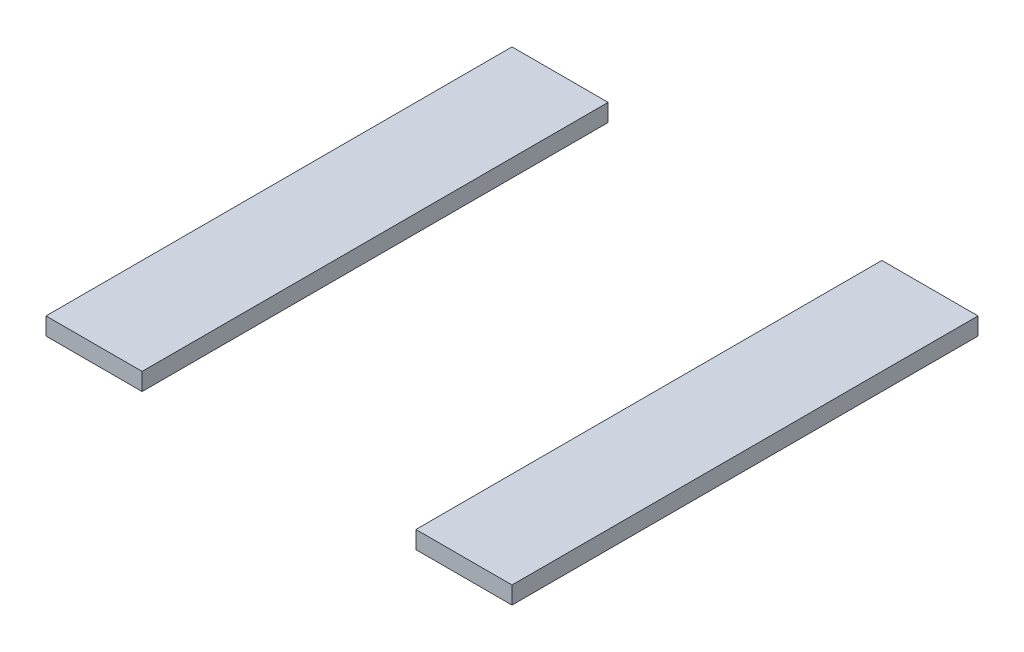
ISO-10303-21;
HEADER;
FILE_DESCRIPTION(('STEP AP214'),'2;1');
FILE_NAME('part.step','',(''),(''),'','','');
FILE_SCHEMA(('AUTOMOTIVE_DESIGN { 1 0 10303 214 1 1 1 1 }'));
ENDSEC;
DATA;
#1=APPLICATION_CONTEXT('core data for automotive mechanical design processes');
#2=APPLICATION_PROTOCOL_DEFINITION('international standard','automotive_design',2000,#1);
#3=PRODUCT_CONTEXT('',#1,'mechanical');
#4=PRODUCT('Part','Part','',(#3));
#5=PRODUCT_RELATED_PRODUCT_CATEGORY('part','',(#4));
#6=PRODUCT_DEFINITION_FORMATION('','',#4);
#7=PRODUCT_DEFINITION_CONTEXT('part definition',#1,'design');
#8=PRODUCT_DEFINITION('design','',#6,#7);
#9=PRODUCT_DEFINITION_SHAPE('','',#8);
#10=(LENGTH_UNIT() NAMED_UNIT(*) SI_UNIT(.MILLI.,.METRE.));
#11=(NAMED_UNIT(*) PLANE_ANGLE_UNIT() SI_UNIT($,.RADIAN.));
#12=(NAMED_UNIT(*) SI_UNIT($,.STERADIAN.) SOLID_ANGLE_UNIT());
#13=UNCERTAINTY_MEASURE_WITH_UNIT(LENGTH_MEASURE(1.E-05),#10,'distance_accuracy_value','');
#14=(GEOMETRIC_REPRESENTATION_CONTEXT(3) GLOBAL_UNCERTAINTY_ASSIGNED_CONTEXT((#13)) GLOBAL_UNIT_ASSIGNED_CONTEXT((#10,
#11,#12)) REPRESENTATION_CONTEXT('',''));
#15=CARTESIAN_POINT('',(0.,0.,0.));
#16=DIRECTION('',(0.,0.,1.));
#17=DIRECTION('',(1.,0.,0.));
#18=AXIS2_PLACEMENT_3D('',#15,#16,#17);
#19=CARTESIAN_POINT('',(-63.5,-3.,-80.));
#20=DIRECTION('',(0.,0.,-1.));
#21=DIRECTION('',(-1.,0.,0.));
#22=AXIS2_PLACEMENT_3D('',#19,#20,#21);
#23=PLANE('',#22);
#24=DIRECTION('',(-1.,0.,0.));
#25=VECTOR('',#24,1.);
#26=CARTESIAN_POINT('',(-63.5,0.,-80.));
#27=LINE('',#26,#25);
#28=CARTESIAN_POINT('',(-63.5,0.,-80.));
#29=VERTEX_POINT('',#28);
#30=CARTESIAN_POINT('',(-80.,0.,-80.));
#31=VERTEX_POINT('',#30);
#32=EDGE_CURVE('E107',#29,#31,#27,.T.);
#33=ORIENTED_EDGE('',*,*,#32,.F.);
#34=DIRECTION('',(0.,1.,0.));
#35=VECTOR('',#34,1.);
#36=CARTESIAN_POINT('',(-63.5,-3.,-80.));
#37=LINE('',#36,#35);
#38=CARTESIAN_POINT('',(-63.5,-3.,-80.));
#39=VERTEX_POINT('',#38);
#40=EDGE_CURVE('E12',#39,#29,#37,.T.);
#41=ORIENTED_EDGE('',*,*,#40,.F.);
#42=DIRECTION('',(-1.,0.,0.));
#43=VECTOR('',#42,1.);
#44=CARTESIAN_POINT('',(-63.5,-3.,-80.));
#45=LINE('',#44,#43);
#46=CARTESIAN_POINT('',(-80.,-3.,-80.));
#47=VERTEX_POINT('',#46);
#48=EDGE_CURVE('E101',#39,#47,#45,.T.);
#49=ORIENTED_EDGE('',*,*,#48,.T.);
#50=DIRECTION('',(0.,1.,0.));
#51=VECTOR('',#50,1.);
#52=CARTESIAN_POINT('',(-80.,-3.,-80.));
#53=LINE('',#52,#51);
#54=EDGE_CURVE('E46',#47,#31,#53,.T.);
#55=ORIENTED_EDGE('',*,*,#54,.T.);
#56=EDGE_LOOP('',(#33,#41,#49,#55));
#57=FACE_BOUND('',#56,.T.);
#58=ADVANCED_FACE('F43',(#57),#23,.T.);
#59=CARTESIAN_POINT('',(-63.5,-3.,0.));
#60=DIRECTION('',(1.,0.,0.));
#61=DIRECTION('',(0.,0.,-1.));
#62=AXIS2_PLACEMENT_3D('',#59,#60,#61);
#63=PLANE('',#62);
#64=DIRECTION('',(0.,0.,-1.));
#65=VECTOR('',#64,1.);
#66=CARTESIAN_POINT('',(-63.5,0.,0.));
#67=LINE('',#66,#65);
#68=CARTESIAN_POINT('',(-63.5,0.,0.));
#69=VERTEX_POINT('',#68);
#70=EDGE_CURVE('E103',#69,#29,#67,.T.);
#71=ORIENTED_EDGE('',*,*,#70,.F.);
#72=DIRECTION('',(0.,1.,0.));
#73=VECTOR('',#72,1.);
#74=CARTESIAN_POINT('',(-63.5,-3.,0.));
#75=LINE('',#74,#73);
#76=CARTESIAN_POINT('',(-63.5,-3.,0.));
#77=VERTEX_POINT('',#76);
#78=EDGE_CURVE('E52',#77,#69,#75,.T.);
#79=ORIENTED_EDGE('',*,*,#78,.F.);
#80=DIRECTION('',(0.,0.,-1.));
#81=VECTOR('',#80,1.);
#82=CARTESIAN_POINT('',(-63.5,-3.,0.));
#83=LINE('',#82,#81);
#84=EDGE_CURVE('E98',#77,#39,#83,.T.);
#85=ORIENTED_EDGE('',*,*,#84,.T.);
#86=ORIENTED_EDGE('',*,*,#40,.T.);
#87=EDGE_LOOP('',(#71,#79,#85,#86));
#88=FACE_BOUND('',#87,.T.);
#89=ADVANCED_FACE('F117',(#88),#63,.T.);
#90=CARTESIAN_POINT('',(-80.,-3.,0.));
#91=DIRECTION('',(0.,0.,1.));
#92=DIRECTION('',(1.,0.,0.));
#93=AXIS2_PLACEMENT_3D('',#90,#91,#92);
#94=PLANE('',#93);
#95=DIRECTION('',(1.,0.,0.));
#96=VECTOR('',#95,1.);
#97=CARTESIAN_POINT('',(-80.,0.,0.));
#98=LINE('',#97,#96);
#99=CARTESIAN_POINT('',(-80.,0.,0.));
#100=VERTEX_POINT('',#99);
#101=EDGE_CURVE('E93',#100,#69,#98,.T.);
#102=ORIENTED_EDGE('',*,*,#101,.F.);
#103=DIRECTION('',(0.,1.,0.));
#104=VECTOR('',#103,1.);
#105=CARTESIAN_POINT('',(-80.,-3.,0.));
#106=LINE('',#105,#104);
#107=CARTESIAN_POINT('',(-80.,-3.,0.));
#108=VERTEX_POINT('',#107);
#109=EDGE_CURVE('E88',#108,#100,#106,.T.);
#110=ORIENTED_EDGE('',*,*,#109,.F.);
#111=DIRECTION('',(1.,0.,0.));
#112=VECTOR('',#111,1.);
#113=CARTESIAN_POINT('',(-80.,-3.,0.));
#114=LINE('',#113,#112);
#115=EDGE_CURVE('E91',#108,#77,#114,.T.);
#116=ORIENTED_EDGE('',*,*,#115,.T.);
#117=ORIENTED_EDGE('',*,*,#78,.T.);
#118=EDGE_LOOP('',(#102,#110,#116,#117));
#119=FACE_BOUND('',#118,.T.);
#120=ADVANCED_FACE('F90',(#119),#94,.T.);
#121=CARTESIAN_POINT('',(-80.,-3.,0.));
#122=DIRECTION('',(-1.,0.,0.));
#123=DIRECTION('',(0.,0.,1.));
#124=AXIS2_PLACEMENT_3D('',#121,#122,#123);
#125=PLANE('',#124);
#126=DIRECTION('',(0.,0.,1.));
#127=VECTOR('',#126,1.);
#128=CARTESIAN_POINT('',(-80.,0.,0.));
#129=LINE('',#128,#127);
#130=EDGE_CURVE('E110',#31,#100,#129,.T.);
#131=ORIENTED_EDGE('',*,*,#130,.F.);
#132=ORIENTED_EDGE('',*,*,#54,.F.);
#133=DIRECTION('',(0.,0.,1.));
#134=VECTOR('',#133,1.);
#135=CARTESIAN_POINT('',(-80.,-3.,0.));
#136=LINE('',#135,#134);
#137=EDGE_CURVE('E97',#47,#108,#136,.T.);
#138=ORIENTED_EDGE('',*,*,#137,.T.);
#139=ORIENTED_EDGE('',*,*,#109,.T.);
#140=EDGE_LOOP('',(#131,#132,#138,#139));
#141=FACE_BOUND('',#140,.T.);
#142=ADVANCED_FACE('F100',(#141),#125,.T.);
#143=CARTESIAN_POINT('',(0.,-3.,0.));
#144=DIRECTION('',(0.,-1.,0.));
#145=DIRECTION('',(0.,0.,-1.));
#146=AXIS2_PLACEMENT_3D('',#143,#144,#145);
#147=PLANE('',#146);
#148=ORIENTED_EDGE('',*,*,#48,.F.);
#149=ORIENTED_EDGE('',*,*,#84,.F.);
#150=ORIENTED_EDGE('',*,*,#115,.F.);
#151=ORIENTED_EDGE('',*,*,#137,.F.);
#152=EDGE_LOOP('',(#148,#149,#150,#151));
#153=FACE_BOUND('',#152,.T.);
#154=ADVANCED_FACE('F96',(#153),#147,.T.);
#155=CARTESIAN_POINT('',(0.,0.,0.));
#156=DIRECTION('',(0.,-1.,0.));
#157=DIRECTION('',(0.,0.,-1.));
#158=AXIS2_PLACEMENT_3D('',#155,#156,#157);
#159=PLANE('',#158);
#160=ORIENTED_EDGE('',*,*,#32,.T.);
#161=ORIENTED_EDGE('',*,*,#130,.T.);
#162=ORIENTED_EDGE('',*,*,#101,.T.);
#163=ORIENTED_EDGE('',*,*,#70,.T.);
#164=EDGE_LOOP('',(#160,#161,#162,#163));
#165=FACE_BOUND('',#164,.T.);
#166=ADVANCED_FACE('F116',(#165),#159,.F.);
#167=CLOSED_SHELL('',(#58,#89,#120,#142,#154,#166));
#168=MANIFOLD_SOLID_BREP('B2',#167);
#169=CARTESIAN_POINT('',(-16.5,-3.,0.));
#170=DIRECTION('',(0.,0.,1.));
#171=DIRECTION('',(1.,0.,0.));
#172=AXIS2_PLACEMENT_3D('',#169,#170,#171);
#173=PLANE('',#172);
#174=DIRECTION('',(1.,0.,0.));
#175=VECTOR('',#174,1.);
#176=CARTESIAN_POINT('',(-16.5,0.,0.));
#177=LINE('',#176,#175);
#178=CARTESIAN_POINT('',(-16.5,0.,0.));
#179=VERTEX_POINT('',#178);
#180=CARTESIAN_POINT('',(0.,0.,0.));
#181=VERTEX_POINT('',#180);
#182=EDGE_CURVE('E231',#179,#181,#177,.T.);
#183=ORIENTED_EDGE('',*,*,#182,.F.);
#184=DIRECTION('',(0.,1.,0.));
#185=VECTOR('',#184,1.);
#186=CARTESIAN_POINT('',(-16.5,-3.,0.));
#187=LINE('',#186,#185);
#188=CARTESIAN_POINT('',(-16.5,-3.,0.));
#189=VERTEX_POINT('',#188);
#190=EDGE_CURVE('E41',#189,#179,#187,.T.);
#191=ORIENTED_EDGE('',*,*,#190,.F.);
#192=DIRECTION('',(1.,0.,0.));
#193=VECTOR('',#192,1.);
#194=CARTESIAN_POINT('',(-16.5,-3.,0.));
#195=LINE('',#194,#193);
#196=CARTESIAN_POINT('',(0.,-3.,0.));
#197=VERTEX_POINT('',#196);
#198=EDGE_CURVE('E225',#189,#197,#195,.T.);
#199=ORIENTED_EDGE('',*,*,#198,.T.);
#200=DIRECTION('',(0.,1.,0.));
#201=VECTOR('',#200,1.);
#202=CARTESIAN_POINT('',(0.,-3.,0.));
#203=LINE('',#202,#201);
#204=EDGE_CURVE('E170',#197,#181,#203,.T.);
#205=ORIENTED_EDGE('',*,*,#204,.T.);
#206=EDGE_LOOP('',(#183,#191,#199,#205));
#207=FACE_BOUND('',#206,.T.);
#208=ADVANCED_FACE('F167',(#207),#173,.T.);
#209=CARTESIAN_POINT('',(-16.5,-3.,0.));
#210=DIRECTION('',(-1.,0.,0.));
#211=DIRECTION('',(0.,0.,1.));
#212=AXIS2_PLACEMENT_3D('',#209,#210,#211);
#213=PLANE('',#212);
#214=DIRECTION('',(0.,0.,1.));
#215=VECTOR('',#214,1.);
#216=CARTESIAN_POINT('',(-16.5,0.,0.));
#217=LINE('',#216,#215);
#218=CARTESIAN_POINT('',(-16.5,0.,-80.));
#219=VERTEX_POINT('',#218);
#220=EDGE_CURVE('E227',#219,#179,#217,.T.);
#221=ORIENTED_EDGE('',*,*,#220,.F.);
#222=DIRECTION('',(0.,1.,0.));
#223=VECTOR('',#222,1.);
#224=CARTESIAN_POINT('',(-16.5,-3.,-80.));
#225=LINE('',#224,#223);
#226=CARTESIAN_POINT('',(-16.5,-3.,-80.));
#227=VERTEX_POINT('',#226);
#228=EDGE_CURVE('E176',#227,#219,#225,.T.);
#229=ORIENTED_EDGE('',*,*,#228,.F.);
#230=DIRECTION('',(0.,0.,1.));
#231=VECTOR('',#230,1.);
#232=CARTESIAN_POINT('',(-16.5,-3.,0.));
#233=LINE('',#232,#231);
#234=EDGE_CURVE('E222',#227,#189,#233,.T.);
#235=ORIENTED_EDGE('',*,*,#234,.T.);
#236=ORIENTED_EDGE('',*,*,#190,.T.);
#237=EDGE_LOOP('',(#221,#229,#235,#236));
#238=FACE_BOUND('',#237,.T.);
#239=ADVANCED_FACE('F241',(#238),#213,.T.);
#240=CARTESIAN_POINT('',(0.,-3.,-80.));
#241=DIRECTION('',(0.,0.,-1.));
#242=DIRECTION('',(-1.,0.,0.));
#243=AXIS2_PLACEMENT_3D('',#240,#241,#242);
#244=PLANE('',#243);
#245=DIRECTION('',(-1.,0.,0.));
#246=VECTOR('',#245,1.);
#247=CARTESIAN_POINT('',(0.,0.,-80.));
#248=LINE('',#247,#246);
#249=CARTESIAN_POINT('',(0.,0.,-80.));
#250=VERTEX_POINT('',#249);
#251=EDGE_CURVE('E217',#250,#219,#248,.T.);
#252=ORIENTED_EDGE('',*,*,#251,.F.);
#253=DIRECTION('',(0.,1.,0.));
#254=VECTOR('',#253,1.);
#255=CARTESIAN_POINT('',(0.,-3.,-80.));
#256=LINE('',#255,#254);
#257=CARTESIAN_POINT('',(0.,-3.,-80.));
#258=VERTEX_POINT('',#257);
#259=EDGE_CURVE('E212',#258,#250,#256,.T.);
#260=ORIENTED_EDGE('',*,*,#259,.F.);
#261=DIRECTION('',(-1.,0.,0.));
#262=VECTOR('',#261,1.);
#263=CARTESIAN_POINT('',(0.,-3.,-80.));
#264=LINE('',#263,#262);
#265=EDGE_CURVE('E215',#258,#227,#264,.T.);
#266=ORIENTED_EDGE('',*,*,#265,.T.);
#267=ORIENTED_EDGE('',*,*,#228,.T.);
#268=EDGE_LOOP('',(#252,#260,#266,#267));
#269=FACE_BOUND('',#268,.T.);
#270=ADVANCED_FACE('F214',(#269),#244,.T.);
#271=CARTESIAN_POINT('',(0.,-3.,0.));
#272=DIRECTION('',(1.,0.,0.));
#273=DIRECTION('',(0.,0.,-1.));
#274=AXIS2_PLACEMENT_3D('',#271,#272,#273);
#275=PLANE('',#274);
#276=DIRECTION('',(0.,0.,-1.));
#277=VECTOR('',#276,1.);
#278=CARTESIAN_POINT('',(0.,0.,0.));
#279=LINE('',#278,#277);
#280=EDGE_CURVE('E234',#181,#250,#279,.T.);
#281=ORIENTED_EDGE('',*,*,#280,.F.);
#282=ORIENTED_EDGE('',*,*,#204,.F.);
#283=DIRECTION('',(0.,0.,-1.));
#284=VECTOR('',#283,1.);
#285=CARTESIAN_POINT('',(0.,-3.,0.));
#286=LINE('',#285,#284);
#287=EDGE_CURVE('E221',#197,#258,#286,.T.);
#288=ORIENTED_EDGE('',*,*,#287,.T.);
#289=ORIENTED_EDGE('',*,*,#259,.T.);
#290=EDGE_LOOP('',(#281,#282,#288,#289));
#291=FACE_BOUND('',#290,.T.);
#292=ADVANCED_FACE('F224',(#291),#275,.T.);
#293=CARTESIAN_POINT('',(0.,-3.,0.));
#294=DIRECTION('',(0.,1.,0.));
#295=DIRECTION('',(0.,0.,1.));
#296=AXIS2_PLACEMENT_3D('',#293,#294,#295);
#297=PLANE('',#296);
#298=ORIENTED_EDGE('',*,*,#198,.F.);
#299=ORIENTED_EDGE('',*,*,#234,.F.);
#300=ORIENTED_EDGE('',*,*,#265,.F.);
#301=ORIENTED_EDGE('',*,*,#287,.F.);
#302=EDGE_LOOP('',(#298,#299,#300,#301));
#303=FACE_BOUND('',#302,.T.);
#304=ADVANCED_FACE('F220',(#303),#297,.F.);
#305=CARTESIAN_POINT('',(0.,0.,0.));
#306=DIRECTION('',(0.,1.,0.));
#307=DIRECTION('',(0.,0.,1.));
#308=AXIS2_PLACEMENT_3D('',#305,#306,#307);
#309=PLANE('',#308);
#310=ORIENTED_EDGE('',*,*,#182,.T.);
#311=ORIENTED_EDGE('',*,*,#280,.T.);
#312=ORIENTED_EDGE('',*,*,#251,.T.);
#313=ORIENTED_EDGE('',*,*,#220,.T.);
#314=EDGE_LOOP('',(#310,#311,#312,#313));
#315=FACE_BOUND('',#314,.T.);
#316=ADVANCED_FACE('F240',(#315),#309,.T.);
#317=CLOSED_SHELL('',(#208,#239,#270,#292,#304,#316));
#318=MANIFOLD_SOLID_BREP('B6',#317);
#319=ADVANCED_BREP_SHAPE_REPRESENTATION('',(#18,#168,#318),#14);
#320=SHAPE_DEFINITION_REPRESENTATION(#9,#319);
ENDSEC;
END-ISO-10303-21;
